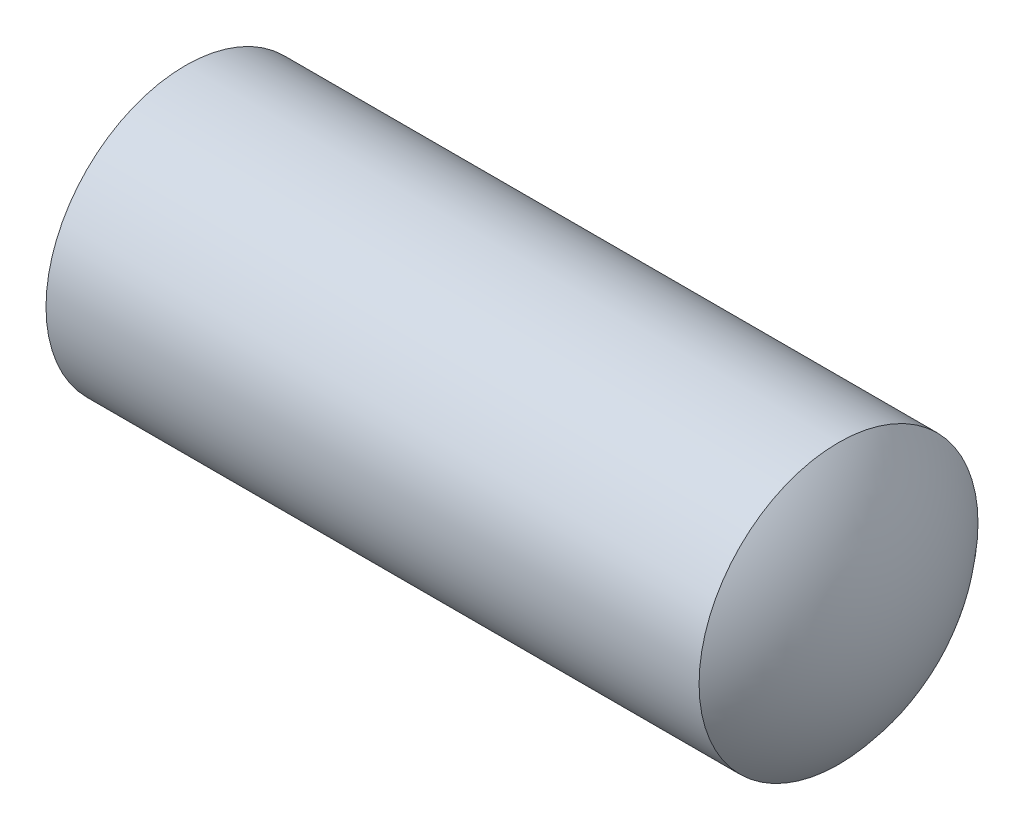
ISO-10303-21;
HEADER;
FILE_DESCRIPTION(('STEP AP214'),'2;1');
FILE_NAME('part.step','',(''),(''),'','','');
FILE_SCHEMA(('AUTOMOTIVE_DESIGN { 1 0 10303 214 1 1 1 1 }'));
ENDSEC;
DATA;
#1=APPLICATION_CONTEXT('core data for automotive mechanical design processes');
#2=APPLICATION_PROTOCOL_DEFINITION('international standard','automotive_design',2000,#1);
#3=PRODUCT_CONTEXT('',#1,'mechanical');
#4=PRODUCT('Part','Part','',(#3));
#5=PRODUCT_RELATED_PRODUCT_CATEGORY('part','',(#4));
#6=PRODUCT_DEFINITION_FORMATION('','',#4);
#7=PRODUCT_DEFINITION_CONTEXT('part definition',#1,'design');
#8=PRODUCT_DEFINITION('design','',#6,#7);
#9=PRODUCT_DEFINITION_SHAPE('','',#8);
#10=(LENGTH_UNIT() NAMED_UNIT(*) SI_UNIT(.MILLI.,.METRE.));
#11=(NAMED_UNIT(*) PLANE_ANGLE_UNIT() SI_UNIT($,.RADIAN.));
#12=(NAMED_UNIT(*) SI_UNIT($,.STERADIAN.) SOLID_ANGLE_UNIT());
#13=UNCERTAINTY_MEASURE_WITH_UNIT(LENGTH_MEASURE(1.E-05),#10,'distance_accuracy_value','');
#14=(GEOMETRIC_REPRESENTATION_CONTEXT(3) GLOBAL_UNCERTAINTY_ASSIGNED_CONTEXT((#13)) GLOBAL_UNIT_ASSIGNED_CONTEXT((#10,
#11,#12)) REPRESENTATION_CONTEXT('',''));
#15=CARTESIAN_POINT('',(0.,0.,0.));
#16=DIRECTION('',(0.,0.,1.));
#17=DIRECTION('',(1.,0.,0.));
#18=AXIS2_PLACEMENT_3D('',#15,#16,#17);
#19=CARTESIAN_POINT('',(19.05,0.,0.));
#20=DIRECTION('',(-1.,0.,0.));
#21=DIRECTION('',(0.,1.,0.));
#22=AXIS2_PLACEMENT_3D('',#19,#20,#21);
#23=SPHERICAL_SURFACE('',#22,19.05);
#24=CARTESIAN_POINT('',(2.55221605790645,0.,0.));
#25=DIRECTION('',(-1.,0.,0.));
#26=DIRECTION('',(0.,0.,1.));
#27=AXIS2_PLACEMENT_3D('',#24,#25,#26);
#28=CIRCLE('',#27,9.525);
#29=CARTESIAN_POINT('',(2.55221605790645,0.,9.525));
#30=VERTEX_POINT('',#29);
#31=EDGE_CURVE('E39',#30,#30,#28,.T.);
#32=ORIENTED_EDGE('',*,*,#31,.T.);
#33=EDGE_LOOP('',(#32));
#34=FACE_BOUND('',#33,.T.);
#35=ADVANCED_FACE('F33',(#34),#23,.T.);
#36=CARTESIAN_POINT('',(36.5252,0.,0.));
#37=DIRECTION('',(-1.,0.,0.));
#38=DIRECTION('',(0.,1.,0.));
#39=AXIS2_PLACEMENT_3D('',#36,#37,#38);
#40=SPHERICAL_SURFACE('',#39,14.2748);
#41=CARTESIAN_POINT('',(47.1574288368902,0.,0.));
#42=DIRECTION('',(-1.,0.,0.));
#43=DIRECTION('',(0.,0.,1.));
#44=AXIS2_PLACEMENT_3D('',#41,#42,#43);
#45=CIRCLE('',#44,9.525);
#46=CARTESIAN_POINT('',(47.1574288368902,0.,9.525));
#47=VERTEX_POINT('',#46);
#48=EDGE_CURVE('E10',#47,#47,#45,.T.);
#49=ORIENTED_EDGE('',*,*,#48,.F.);
#50=EDGE_LOOP('',(#49));
#51=FACE_BOUND('',#50,.T.);
#52=ADVANCED_FACE('F48',(#51),#40,.T.);
#53=CARTESIAN_POINT('',(-12.7,0.,0.));
#54=DIRECTION('',(-1.,0.,0.));
#55=DIRECTION('',(0.,0.,1.));
#56=AXIS2_PLACEMENT_3D('',#53,#54,#55);
#57=CYLINDRICAL_SURFACE('',#56,9.525);
#58=ORIENTED_EDGE('',*,*,#48,.T.);
#59=EDGE_LOOP('',(#58));
#60=FACE_BOUND('',#59,.T.);
#61=ORIENTED_EDGE('',*,*,#31,.F.);
#62=EDGE_LOOP('',(#61));
#63=FACE_BOUND('',#62,.T.);
#64=ADVANCED_FACE('F46',(#60,#63),#57,.T.);
#65=CLOSED_SHELL('',(#35,#52,#64));
#66=MANIFOLD_SOLID_BREP('B2',#65);
#67=ADVANCED_BREP_SHAPE_REPRESENTATION('',(#18,#66),#14);
#68=SHAPE_DEFINITION_REPRESENTATION(#9,#67);
ENDSEC;
END-ISO-10303-21;
